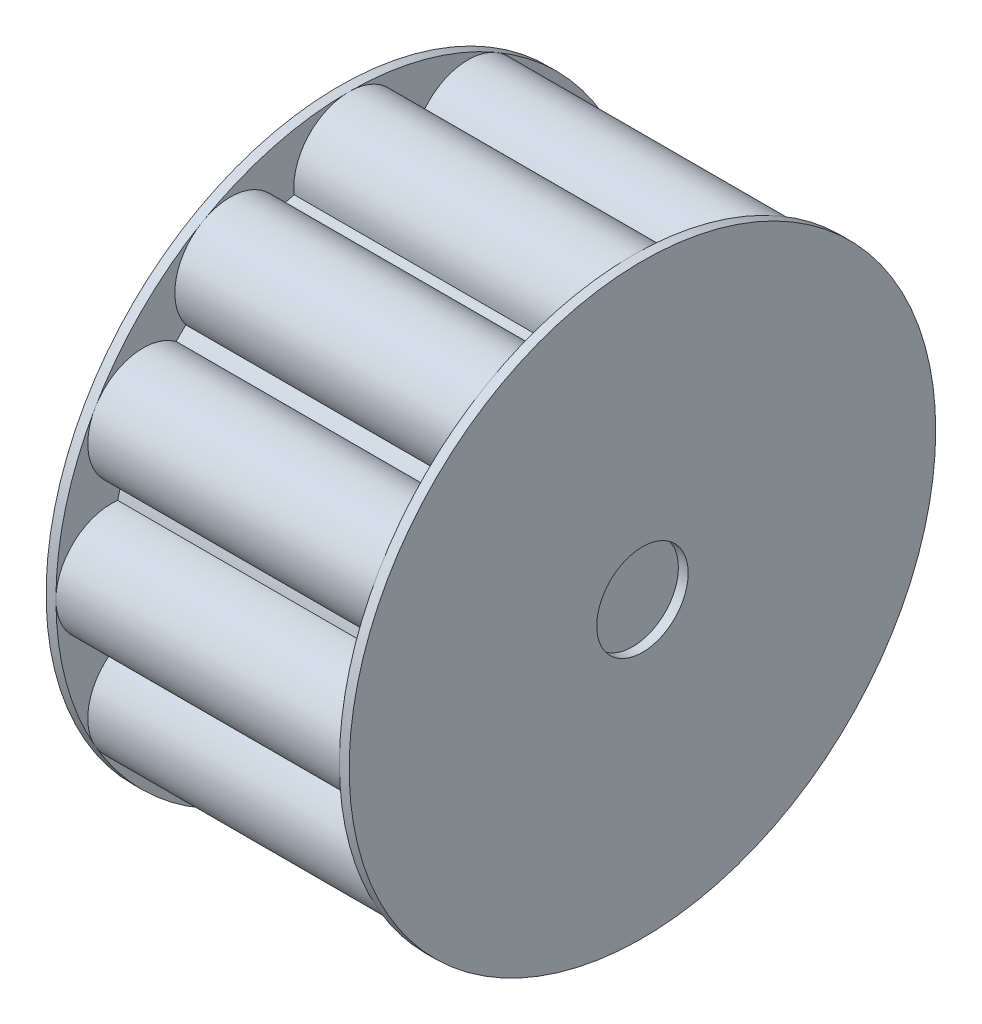
ISO-10303-21;
HEADER;
FILE_DESCRIPTION(('STEP AP214'),'2;1');
FILE_NAME('part.step','',(''),(''),'','','');
FILE_SCHEMA(('AUTOMOTIVE_DESIGN { 1 0 10303 214 1 1 1 1 }'));
ENDSEC;
DATA;
#1=APPLICATION_CONTEXT('core data for automotive mechanical design processes');
#2=APPLICATION_PROTOCOL_DEFINITION('international standard','automotive_design',2000,#1);
#3=PRODUCT_CONTEXT('',#1,'mechanical');
#4=PRODUCT('Part','Part','',(#3));
#5=PRODUCT_RELATED_PRODUCT_CATEGORY('part','',(#4));
#6=PRODUCT_DEFINITION_FORMATION('','',#4);
#7=PRODUCT_DEFINITION_CONTEXT('part definition',#1,'design');
#8=PRODUCT_DEFINITION('design','',#6,#7);
#9=PRODUCT_DEFINITION_SHAPE('','',#8);
#10=(LENGTH_UNIT() NAMED_UNIT(*) SI_UNIT(.MILLI.,.METRE.));
#11=(NAMED_UNIT(*) PLANE_ANGLE_UNIT() SI_UNIT($,.RADIAN.));
#12=(NAMED_UNIT(*) SI_UNIT($,.STERADIAN.) SOLID_ANGLE_UNIT());
#13=UNCERTAINTY_MEASURE_WITH_UNIT(LENGTH_MEASURE(1.E-05),#10,'distance_accuracy_value','');
#14=(GEOMETRIC_REPRESENTATION_CONTEXT(3) GLOBAL_UNCERTAINTY_ASSIGNED_CONTEXT((#13)) GLOBAL_UNIT_ASSIGNED_CONTEXT((#10,
#11,#12)) REPRESENTATION_CONTEXT('',''));
#15=CARTESIAN_POINT('',(0.,0.,0.));
#16=DIRECTION('',(0.,0.,1.));
#17=DIRECTION('',(1.,0.,0.));
#18=AXIS2_PLACEMENT_3D('',#15,#16,#17);
#19=CARTESIAN_POINT('',(30.,0.,0.));
#20=DIRECTION('',(-1.,0.,0.));
#21=DIRECTION('',(0.,0.,1.));
#22=AXIS2_PLACEMENT_3D('',#19,#20,#21);
#23=CYLINDRICAL_SURFACE('',#22,24.3358514709171);
#24=CARTESIAN_POINT('',(1.,0.,0.));
#25=DIRECTION('',(1.,0.,0.));
#26=DIRECTION('',(0.,0.,-1.));
#27=AXIS2_PLACEMENT_3D('',#24,#25,#26);
#28=CIRCLE('',#27,24.3358514709171);
#29=CARTESIAN_POINT('',(1.,23.6766886181635,5.62566288476854));
#30=VERTEX_POINT('',#29);
#31=CARTESIAN_POINT('',(1.,23.317445263208,6.96637733774414));
#32=VERTEX_POINT('',#31);
#33=EDGE_CURVE('E11',#30,#32,#28,.T.);
#34=ORIENTED_EDGE('',*,*,#33,.T.);
#35=DIRECTION('',(1.,0.,0.));
#36=VECTOR('',#35,1.);
#37=CARTESIAN_POINT('',(15.5,23.317445263208,6.96637733774413));
#38=LINE('',#37,#36);
#39=CARTESIAN_POINT('',(30.,23.317445263208,6.96637733774414));
#40=VERTEX_POINT('',#39);
#41=EDGE_CURVE('E283',#32,#40,#38,.T.);
#42=ORIENTED_EDGE('',*,*,#41,.T.);
#43=CARTESIAN_POINT('',(30.,0.,0.));
#44=DIRECTION('',(1.,0.,0.));
#45=DIRECTION('',(0.,0.,-1.));
#46=AXIS2_PLACEMENT_3D('',#43,#44,#45);
#47=CIRCLE('',#46,24.3358514709171);
#48=CARTESIAN_POINT('',(30.,23.6766886181635,5.62566288476854));
#49=VERTEX_POINT('',#48);
#50=EDGE_CURVE('E279',#49,#40,#47,.T.);
#51=ORIENTED_EDGE('',*,*,#50,.F.);
#52=DIRECTION('',(1.,0.,0.));
#53=VECTOR('',#52,1.);
#54=CARTESIAN_POINT('',(15.5,23.6766886181635,5.62566288476854));
#55=LINE('',#54,#53);
#56=EDGE_CURVE('E280',#49,#30,#55,.F.);
#57=ORIENTED_EDGE('',*,*,#56,.T.);
#58=EDGE_LOOP('',(#34,#42,#51,#57));
#59=FACE_BOUND('',#58,.T.);
#60=ADVANCED_FACE('F41',(#59),#23,.T.);
#61=CARTESIAN_POINT('',(1.,0.,0.));
#62=DIRECTION('',(1.,0.,0.));
#63=DIRECTION('',(0.,0.,-1.));
#64=AXIS2_PLACEMENT_3D('',#61,#62,#63);
#65=PLANE('',#64);
#66=CARTESIAN_POINT('',(1.,21.0754655965377,12.1679257354582));
#67=DIRECTION('',(1.,0.,0.));
#68=DIRECTION('',(0.,0.,-1.));
#69=AXIS2_PLACEMENT_3D('',#66,#67,#68);
#70=CIRCLE('',#69,5.66414852908402);
#71=CARTESIAN_POINT('',(1.,25.9807621135329,15.0000000000004));
#72=VERTEX_POINT('',#71);
#73=EDGE_CURVE('E544',#32,#72,#70,.T.);
#74=ORIENTED_EDGE('',*,*,#73,.F.);
#75=ORIENTED_EDGE('',*,*,#33,.F.);
#76=CARTESIAN_POINT('',(1.,24.3358514709171,0.));
#77=DIRECTION('',(1.,0.,0.));
#78=DIRECTION('',(0.,0.,-1.));
#79=AXIS2_PLACEMENT_3D('',#76,#77,#78);
#80=CIRCLE('',#79,5.66414852908295);
#81=CARTESIAN_POINT('',(1.,30.,0.));
#82=VERTEX_POINT('',#81);
#83=EDGE_CURVE('E295',#82,#30,#80,.T.);
#84=ORIENTED_EDGE('',*,*,#83,.F.);
#85=CARTESIAN_POINT('',(1.,0.,0.));
#86=DIRECTION('',(1.,0.,0.));
#87=DIRECTION('',(0.,0.,-1.));
#88=AXIS2_PLACEMENT_3D('',#85,#86,#87);
#89=CIRCLE('',#88,30.);
#90=EDGE_CURVE('E318',#82,#72,#89,.T.);
#91=ORIENTED_EDGE('',*,*,#90,.T.);
#92=EDGE_LOOP('',(#74,#75,#84,#91));
#93=FACE_BOUND('',#92,.T.);
#94=ADVANCED_FACE('F357',(#93),#65,.T.);
#95=CARTESIAN_POINT('',(30.,17.6917823784381,16.7103112804197));
#96=VERTEX_POINT('',#95);
#97=CARTESIAN_POINT('',(30.,16.7103112804194,17.6917823784384));
#98=VERTEX_POINT('',#97);
#99=EDGE_CURVE('E288',#96,#98,#47,.T.);
#100=ORIENTED_EDGE('',*,*,#99,.F.);
#101=DIRECTION('',(1.,0.,0.));
#102=VECTOR('',#101,1.);
#103=CARTESIAN_POINT('',(15.5,17.6917823784381,16.7103112804197));
#104=LINE('',#103,#102);
#105=CARTESIAN_POINT('',(1.,17.6917823784381,16.7103112804197));
#106=VERTEX_POINT('',#105);
#107=EDGE_CURVE('E536',#96,#106,#104,.F.);
#108=ORIENTED_EDGE('',*,*,#107,.T.);
#109=CARTESIAN_POINT('',(1.,16.7103112804194,17.6917823784384));
#110=VERTEX_POINT('',#109);
#111=EDGE_CURVE('E51',#106,#110,#28,.T.);
#112=ORIENTED_EDGE('',*,*,#111,.T.);
#113=DIRECTION('',(1.,0.,0.));
#114=VECTOR('',#113,1.);
#115=CARTESIAN_POINT('',(15.5,16.7103112804194,17.6917823784384));
#116=LINE('',#115,#114);
#117=EDGE_CURVE('E539',#110,#98,#116,.T.);
#118=ORIENTED_EDGE('',*,*,#117,.T.);
#119=EDGE_LOOP('',(#100,#108,#112,#118));
#120=FACE_BOUND('',#119,.T.);
#121=ADVANCED_FACE('F361',(#120),#23,.T.);
#122=EDGE_CURVE('E542',#72,#106,#70,.T.);
#123=ORIENTED_EDGE('',*,*,#122,.F.);
#124=CARTESIAN_POINT('',(1.,14.9999999999985,25.980762113534));
#125=VERTEX_POINT('',#124);
#126=EDGE_CURVE('E321',#72,#125,#89,.T.);
#127=ORIENTED_EDGE('',*,*,#126,.T.);
#128=CARTESIAN_POINT('',(1.,12.1679257354561,21.0754655965377));
#129=DIRECTION('',(1.,0.,0.));
#130=DIRECTION('',(0.,0.,-1.));
#131=AXIS2_PLACEMENT_3D('',#128,#129,#130);
#132=CIRCLE('',#131,5.66414852908526);
#133=EDGE_CURVE('E554',#110,#125,#132,.T.);
#134=ORIENTED_EDGE('',*,*,#133,.F.);
#135=ORIENTED_EDGE('',*,*,#111,.F.);
#136=EDGE_LOOP('',(#123,#127,#134,#135));
#137=FACE_BOUND('',#136,.T.);
#138=ADVANCED_FACE('F365',(#137),#65,.T.);
#139=CARTESIAN_POINT('',(30.,6.96637733774112,23.3174452632089));
#140=VERTEX_POINT('',#139);
#141=CARTESIAN_POINT('',(30.,5.62566288476978,23.6766886181632));
#142=VERTEX_POINT('',#141);
#143=EDGE_CURVE('E521',#140,#142,#47,.T.);
#144=ORIENTED_EDGE('',*,*,#143,.F.);
#145=DIRECTION('',(1.,0.,0.));
#146=VECTOR('',#145,1.);
#147=CARTESIAN_POINT('',(15.5,6.96637733774111,23.3174452632089));
#148=LINE('',#147,#146);
#149=CARTESIAN_POINT('',(1.,6.96637733774111,23.3174452632089));
#150=VERTEX_POINT('',#149);
#151=EDGE_CURVE('E558',#140,#150,#148,.F.);
#152=ORIENTED_EDGE('',*,*,#151,.T.);
#153=CARTESIAN_POINT('',(1.,5.62566288476978,23.6766886181632));
#154=VERTEX_POINT('',#153);
#155=EDGE_CURVE('E733',#150,#154,#28,.T.);
#156=ORIENTED_EDGE('',*,*,#155,.T.);
#157=DIRECTION('',(1.,0.,0.));
#158=VECTOR('',#157,1.);
#159=CARTESIAN_POINT('',(15.5,5.62566288476979,23.6766886181632));
#160=LINE('',#159,#158);
#161=EDGE_CURVE('E581',#154,#142,#160,.T.);
#162=ORIENTED_EDGE('',*,*,#161,.T.);
#163=EDGE_LOOP('',(#144,#152,#156,#162));
#164=FACE_BOUND('',#163,.T.);
#165=ADVANCED_FACE('F369',(#164),#23,.T.);
#166=EDGE_CURVE('E559',#125,#150,#132,.T.);
#167=ORIENTED_EDGE('',*,*,#166,.F.);
#168=CARTESIAN_POINT('',(1.,-3.40876816145015E-12,30.));
#169=VERTEX_POINT('',#168);
#170=EDGE_CURVE('E329',#125,#169,#89,.T.);
#171=ORIENTED_EDGE('',*,*,#170,.T.);
#172=CARTESIAN_POINT('',(1.,-2.76517585586108E-12,24.3358514709143));
#173=DIRECTION('',(1.,0.,0.));
#174=DIRECTION('',(0.,0.,-1.));
#175=AXIS2_PLACEMENT_3D('',#172,#173,#174);
#176=CIRCLE('',#175,5.66414852908664);
#177=EDGE_CURVE('E568',#154,#169,#176,.T.);
#178=ORIENTED_EDGE('',*,*,#177,.F.);
#179=ORIENTED_EDGE('',*,*,#155,.F.);
#180=EDGE_LOOP('',(#167,#171,#178,#179));
#181=FACE_BOUND('',#180,.T.);
#182=ADVANCED_FACE('F374',(#181),#65,.T.);
#183=CARTESIAN_POINT('',(30.,-5.62566288477516,23.6766886181619));
#184=VERTEX_POINT('',#183);
#185=CARTESIAN_POINT('',(30.,-6.96637733774395,23.317445263208));
#186=VERTEX_POINT('',#185);
#187=EDGE_CURVE('E518',#184,#186,#47,.T.);
#188=ORIENTED_EDGE('',*,*,#187,.F.);
#189=DIRECTION('',(1.,0.,0.));
#190=VECTOR('',#189,1.);
#191=CARTESIAN_POINT('',(15.5,-5.62566288477517,23.6766886181619));
#192=LINE('',#191,#190);
#193=CARTESIAN_POINT('',(1.,-5.62566288477517,23.6766886181619));
#194=VERTEX_POINT('',#193);
#195=EDGE_CURVE('E572',#184,#194,#192,.F.);
#196=ORIENTED_EDGE('',*,*,#195,.T.);
#197=CARTESIAN_POINT('',(1.,-6.96637733774395,23.317445263208));
#198=VERTEX_POINT('',#197);
#199=EDGE_CURVE('E1223',#194,#198,#28,.T.);
#200=ORIENTED_EDGE('',*,*,#199,.T.);
#201=DIRECTION('',(1.,0.,0.));
#202=VECTOR('',#201,1.);
#203=CARTESIAN_POINT('',(15.5,-6.96637733774394,23.317445263208));
#204=LINE('',#203,#202);
#205=EDGE_CURVE('E598',#198,#186,#204,.T.);
#206=ORIENTED_EDGE('',*,*,#205,.T.);
#207=EDGE_LOOP('',(#188,#196,#200,#206));
#208=FACE_BOUND('',#207,.T.);
#209=ADVANCED_FACE('F377',(#208),#23,.T.);
#210=EDGE_CURVE('E573',#169,#194,#176,.T.);
#211=ORIENTED_EDGE('',*,*,#210,.F.);
#212=CARTESIAN_POINT('',(1.,-15.0000000000044,25.9807621135306));
#213=VERTEX_POINT('',#212);
#214=EDGE_CURVE('E1262',#169,#213,#89,.T.);
#215=ORIENTED_EDGE('',*,*,#214,.T.);
#216=CARTESIAN_POINT('',(1.,-12.1679257354609,21.0754655965349));
#217=DIRECTION('',(1.,0.,0.));
#218=DIRECTION('',(0.,0.,-1.));
#219=AXIS2_PLACEMENT_3D('',#216,#217,#218);
#220=CIRCLE('',#219,5.66414852908784);
#221=EDGE_CURVE('E585',#198,#213,#220,.T.);
#222=ORIENTED_EDGE('',*,*,#221,.F.);
#223=ORIENTED_EDGE('',*,*,#199,.F.);
#224=EDGE_LOOP('',(#211,#215,#222,#223));
#225=FACE_BOUND('',#224,.T.);
#226=ADVANCED_FACE('F382',(#225),#65,.T.);
#227=CARTESIAN_POINT('',(30.,-16.7103112804254,17.6917823784328));
#228=VERTEX_POINT('',#227);
#229=CARTESIAN_POINT('',(30.,-17.6917823784388,16.710311280419));
#230=VERTEX_POINT('',#229);
#231=EDGE_CURVE('E515',#228,#230,#47,.T.);
#232=ORIENTED_EDGE('',*,*,#231,.F.);
#233=DIRECTION('',(1.,0.,0.));
#234=VECTOR('',#233,1.);
#235=CARTESIAN_POINT('',(15.5,-16.7103112804254,17.6917823784328));
#236=LINE('',#235,#234);
#237=CARTESIAN_POINT('',(1.,-16.7103112804254,17.6917823784328));
#238=VERTEX_POINT('',#237);
#239=EDGE_CURVE('E589',#228,#238,#236,.F.);
#240=ORIENTED_EDGE('',*,*,#239,.T.);
#241=CARTESIAN_POINT('',(1.,-17.6917823784388,16.710311280419));
#242=VERTEX_POINT('',#241);
#243=EDGE_CURVE('E1226',#238,#242,#28,.T.);
#244=ORIENTED_EDGE('',*,*,#243,.T.);
#245=DIRECTION('',(1.,0.,0.));
#246=VECTOR('',#245,1.);
#247=CARTESIAN_POINT('',(15.5,-17.6917823784388,16.710311280419));
#248=LINE('',#247,#246);
#249=EDGE_CURVE('E615',#242,#230,#248,.T.);
#250=ORIENTED_EDGE('',*,*,#249,.T.);
#251=EDGE_LOOP('',(#232,#240,#244,#250));
#252=FACE_BOUND('',#251,.T.);
#253=ADVANCED_FACE('F385',(#252),#23,.T.);
#254=EDGE_CURVE('E590',#213,#238,#220,.T.);
#255=ORIENTED_EDGE('',*,*,#254,.F.);
#256=CARTESIAN_POINT('',(1.,-25.9807621135363,14.9999999999945));
#257=VERTEX_POINT('',#256);
#258=EDGE_CURVE('E1258',#213,#257,#89,.T.);
#259=ORIENTED_EDGE('',*,*,#258,.T.);
#260=CARTESIAN_POINT('',(1.,-21.0754655965405,12.1679257354534));
#261=DIRECTION('',(1.,0.,0.));
#262=DIRECTION('',(0.,0.,-1.));
#263=AXIS2_PLACEMENT_3D('',#260,#261,#262);
#264=CIRCLE('',#263,5.66414852908847);
#265=EDGE_CURVE('E602',#242,#257,#264,.T.);
#266=ORIENTED_EDGE('',*,*,#265,.F.);
#267=ORIENTED_EDGE('',*,*,#243,.F.);
#268=EDGE_LOOP('',(#255,#259,#266,#267));
#269=FACE_BOUND('',#268,.T.);
#270=ADVANCED_FACE('F390',(#269),#65,.T.);
#271=CARTESIAN_POINT('',(30.,-23.3174452632109,6.96637733773451));
#272=VERTEX_POINT('',#271);
#273=CARTESIAN_POINT('',(30.,-23.6766886181635,5.6256628847685));
#274=VERTEX_POINT('',#273);
#275=EDGE_CURVE('E512',#272,#274,#47,.T.);
#276=ORIENTED_EDGE('',*,*,#275,.F.);
#277=DIRECTION('',(1.,0.,0.));
#278=VECTOR('',#277,1.);
#279=CARTESIAN_POINT('',(15.5,-23.3174452632109,6.96637733773452));
#280=LINE('',#279,#278);
#281=CARTESIAN_POINT('',(1.,-23.3174452632109,6.96637733773452));
#282=VERTEX_POINT('',#281);
#283=EDGE_CURVE('E606',#272,#282,#280,.F.);
#284=ORIENTED_EDGE('',*,*,#283,.T.);
#285=CARTESIAN_POINT('',(1.,-23.6766886181635,5.6256628847685));
#286=VERTEX_POINT('',#285);
#287=EDGE_CURVE('E1229',#282,#286,#28,.T.);
#288=ORIENTED_EDGE('',*,*,#287,.T.);
#289=DIRECTION('',(1.,0.,0.));
#290=VECTOR('',#289,1.);
#291=CARTESIAN_POINT('',(15.5,-23.6766886181635,5.6256628847685));
#292=LINE('',#291,#290);
#293=EDGE_CURVE('E632',#286,#274,#292,.T.);
#294=ORIENTED_EDGE('',*,*,#293,.T.);
#295=EDGE_LOOP('',(#276,#284,#288,#294));
#296=FACE_BOUND('',#295,.T.);
#297=ADVANCED_FACE('F393',(#296),#23,.T.);
#298=EDGE_CURVE('E607',#257,#282,#264,.T.);
#299=ORIENTED_EDGE('',*,*,#298,.F.);
#300=CARTESIAN_POINT('',(1.,-30.,-6.81018844210464E-12));
#301=VERTEX_POINT('',#300);
#302=EDGE_CURVE('E1255',#257,#301,#89,.T.);
#303=ORIENTED_EDGE('',*,*,#302,.T.);
#304=CARTESIAN_POINT('',(1.,-24.3358514709171,-5.52439114720048E-12));
#305=DIRECTION('',(1.,0.,0.));
#306=DIRECTION('',(0.,0.,-1.));
#307=AXIS2_PLACEMENT_3D('',#304,#305,#306);
#308=CIRCLE('',#307,5.66414852908839);
#309=EDGE_CURVE('E623',#286,#301,#308,.T.);
#310=ORIENTED_EDGE('',*,*,#309,.F.);
#311=ORIENTED_EDGE('',*,*,#287,.F.);
#312=EDGE_LOOP('',(#299,#303,#310,#311));
#313=FACE_BOUND('',#312,.T.);
#314=ADVANCED_FACE('F398',(#313),#65,.T.);
#315=CARTESIAN_POINT('',(30.,-23.676688618161,-5.62566288477925));
#316=VERTEX_POINT('',#315);
#317=CARTESIAN_POINT('',(30.,-23.3174452632076,-6.96637733774555));
#318=VERTEX_POINT('',#317);
#319=EDGE_CURVE('E509',#316,#318,#47,.T.);
#320=ORIENTED_EDGE('',*,*,#319,.F.);
#321=DIRECTION('',(1.,0.,0.));
#322=VECTOR('',#321,1.);
#323=CARTESIAN_POINT('',(15.5,-23.676688618161,-5.62566288477925));
#324=LINE('',#323,#322);
#325=CARTESIAN_POINT('',(1.,-23.676688618161,-5.62566288477925));
#326=VERTEX_POINT('',#325);
#327=EDGE_CURVE('E628',#316,#326,#324,.F.);
#328=ORIENTED_EDGE('',*,*,#327,.T.);
#329=CARTESIAN_POINT('',(1.,-23.3174452632076,-6.96637733774555));
#330=VERTEX_POINT('',#329);
#331=EDGE_CURVE('E1232',#326,#330,#28,.T.);
#332=ORIENTED_EDGE('',*,*,#331,.T.);
#333=DIRECTION('',(1.,0.,0.));
#334=VECTOR('',#333,1.);
#335=CARTESIAN_POINT('',(15.5,-23.3174452632076,-6.96637733774554));
#336=LINE('',#335,#334);
#337=EDGE_CURVE('E649',#330,#318,#336,.T.);
#338=ORIENTED_EDGE('',*,*,#337,.T.);
#339=EDGE_LOOP('',(#320,#328,#332,#338));
#340=FACE_BOUND('',#339,.T.);
#341=ADVANCED_FACE('F401',(#340),#23,.T.);
#342=EDGE_CURVE('E619',#301,#326,#308,.T.);
#343=ORIENTED_EDGE('',*,*,#342,.F.);
#344=CARTESIAN_POINT('',(1.,-25.98076211353,-15.0000000000055));
#345=VERTEX_POINT('',#344);
#346=EDGE_CURVE('E1253',#301,#345,#89,.T.);
#347=ORIENTED_EDGE('',*,*,#346,.T.);
#348=CARTESIAN_POINT('',(1.,-21.0754655965377,-12.1679257354637));
#349=DIRECTION('',(1.,0.,0.));
#350=DIRECTION('',(0.,0.,-1.));
#351=AXIS2_PLACEMENT_3D('',#348,#349,#350);
#352=CIRCLE('',#351,5.66414852908762);
#353=EDGE_CURVE('E640',#330,#345,#352,.T.);
#354=ORIENTED_EDGE('',*,*,#353,.F.);
#355=ORIENTED_EDGE('',*,*,#331,.F.);
#356=EDGE_LOOP('',(#343,#347,#354,#355));
#357=FACE_BOUND('',#356,.T.);
#358=ADVANCED_FACE('F406',(#357),#65,.T.);
#359=CARTESIAN_POINT('',(30.,-17.6917823784325,-16.7103112804256));
#360=VERTEX_POINT('',#359);
#361=CARTESIAN_POINT('',(30.,-16.7103112804178,-17.6917823784399));
#362=VERTEX_POINT('',#361);
#363=EDGE_CURVE('E506',#360,#362,#47,.T.);
#364=ORIENTED_EDGE('',*,*,#363,.F.);
#365=DIRECTION('',(1.,0.,0.));
#366=VECTOR('',#365,1.);
#367=CARTESIAN_POINT('',(15.5,-17.6917823784325,-16.7103112804256));
#368=LINE('',#367,#366);
#369=CARTESIAN_POINT('',(1.,-17.6917823784325,-16.7103112804256));
#370=VERTEX_POINT('',#369);
#371=EDGE_CURVE('E645',#360,#370,#368,.F.);
#372=ORIENTED_EDGE('',*,*,#371,.T.);
#373=CARTESIAN_POINT('',(1.,-16.7103112804178,-17.6917823784399));
#374=VERTEX_POINT('',#373);
#375=EDGE_CURVE('E1235',#370,#374,#28,.T.);
#376=ORIENTED_EDGE('',*,*,#375,.T.);
#377=DIRECTION('',(1.,0.,0.));
#378=VECTOR('',#377,1.);
#379=CARTESIAN_POINT('',(15.5,-16.7103112804178,-17.6917823784399));
#380=LINE('',#379,#378);
#381=EDGE_CURVE('E666',#374,#362,#380,.T.);
#382=ORIENTED_EDGE('',*,*,#381,.T.);
#383=EDGE_LOOP('',(#364,#372,#376,#382));
#384=FACE_BOUND('',#383,.T.);
#385=ADVANCED_FACE('F409',(#384),#23,.T.);
#386=EDGE_CURVE('E636',#345,#370,#352,.T.);
#387=ORIENTED_EDGE('',*,*,#386,.F.);
#388=CARTESIAN_POINT('',(1.,-14.9999999999956,-25.9807621135357));
#389=VERTEX_POINT('',#388);
#390=EDGE_CURVE('E1247',#345,#389,#89,.T.);
#391=ORIENTED_EDGE('',*,*,#390,.T.);
#392=CARTESIAN_POINT('',(1.,-12.1679257354561,-21.0754655965432));
#393=DIRECTION('',(1.,0.,0.));
#394=DIRECTION('',(0.,0.,-1.));
#395=AXIS2_PLACEMENT_3D('',#392,#393,#394);
#396=CIRCLE('',#395,5.66414852908633);
#397=EDGE_CURVE('E657',#374,#389,#396,.T.);
#398=ORIENTED_EDGE('',*,*,#397,.F.);
#399=ORIENTED_EDGE('',*,*,#375,.F.);
#400=EDGE_LOOP('',(#387,#391,#398,#399));
#401=FACE_BOUND('',#400,.T.);
#402=ADVANCED_FACE('F414',(#401),#65,.T.);
#403=CARTESIAN_POINT('',(30.,-6.96637733773798,-23.3174452632098));
#404=VERTEX_POINT('',#403);
#405=CARTESIAN_POINT('',(30.,-5.62566288476744,-23.6766886181638));
#406=VERTEX_POINT('',#405);
#407=EDGE_CURVE('E503',#404,#406,#47,.T.);
#408=ORIENTED_EDGE('',*,*,#407,.F.);
#409=DIRECTION('',(1.,0.,0.));
#410=VECTOR('',#409,1.);
#411=CARTESIAN_POINT('',(15.5,-6.96637733773798,-23.3174452632098));
#412=LINE('',#411,#410);
#413=CARTESIAN_POINT('',(1.,-6.96637733773798,-23.3174452632098));
#414=VERTEX_POINT('',#413);
#415=EDGE_CURVE('E662',#404,#414,#412,.F.);
#416=ORIENTED_EDGE('',*,*,#415,.T.);
#417=CARTESIAN_POINT('',(1.,-5.62566288476744,-23.6766886181638));
#418=VERTEX_POINT('',#417);
#419=EDGE_CURVE('E689',#414,#418,#28,.T.);
#420=ORIENTED_EDGE('',*,*,#419,.T.);
#421=DIRECTION('',(1.,0.,0.));
#422=VECTOR('',#421,1.);
#423=CARTESIAN_POINT('',(15.5,-5.62566288476742,-23.6766886181638));
#424=LINE('',#423,#422);
#425=EDGE_CURVE('E474',#418,#406,#424,.T.);
#426=ORIENTED_EDGE('',*,*,#425,.T.);
#427=EDGE_LOOP('',(#408,#416,#420,#426));
#428=FACE_BOUND('',#427,.T.);
#429=ADVANCED_FACE('F417',(#428),#23,.T.);
#430=CARTESIAN_POINT('',(1.,2.76219557360024E-12,-24.3358514709198));
#431=DIRECTION('',(1.,0.,0.));
#432=DIRECTION('',(0.,0.,-1.));
#433=AXIS2_PLACEMENT_3D('',#430,#431,#432);
#434=CIRCLE('',#433,5.66414852908487);
#435=CARTESIAN_POINT('',(1.,3.40509422105246E-12,-30.0000000000047));
#436=VERTEX_POINT('',#435);
#437=CARTESIAN_POINT('',(1.,5.62566288477281,-23.6766886181625));
#438=VERTEX_POINT('',#437);
#439=EDGE_CURVE('E670',#436,#438,#434,.T.);
#440=ORIENTED_EDGE('',*,*,#439,.F.);
#441=CARTESIAN_POINT('',(1.,15.000000000003,-25.980762113535));
#442=VERTEX_POINT('',#441);
#443=EDGE_CURVE('E338',#436,#442,#89,.T.);
#444=ORIENTED_EDGE('',*,*,#443,.T.);
#445=CARTESIAN_POINT('',(1.,12.1679257354609,-21.0754655965404));
#446=DIRECTION('',(1.,0.,0.));
#447=DIRECTION('',(0.,0.,-1.));
#448=AXIS2_PLACEMENT_3D('',#445,#446,#447);
#449=CIRCLE('',#448,5.66414852908362);
#450=CARTESIAN_POINT('',(1.,6.9663773377459,-23.3174452632075));
#451=VERTEX_POINT('',#450);
#452=EDGE_CURVE('E478',#451,#442,#449,.T.);
#453=ORIENTED_EDGE('',*,*,#452,.F.);
#454=EDGE_CURVE('E682',#438,#451,#28,.T.);
#455=ORIENTED_EDGE('',*,*,#454,.F.);
#456=EDGE_LOOP('',(#440,#444,#453,#455));
#457=FACE_BOUND('',#456,.T.);
#458=ADVANCED_FACE('F422',(#457),#65,.T.);
#459=CARTESIAN_POINT('',(30.,5.62566288477281,-23.6766886181625));
#460=VERTEX_POINT('',#459);
#461=CARTESIAN_POINT('',(30.,6.9663773377459,-23.3174452632075));
#462=VERTEX_POINT('',#461);
#463=EDGE_CURVE('E453',#460,#462,#47,.T.);
#464=ORIENTED_EDGE('',*,*,#463,.F.);
#465=DIRECTION('',(1.,0.,0.));
#466=VECTOR('',#465,1.);
#467=CARTESIAN_POINT('',(15.5,5.62566288477279,-23.6766886181625));
#468=LINE('',#467,#466);
#469=EDGE_CURVE('E479',#460,#438,#468,.F.);
#470=ORIENTED_EDGE('',*,*,#469,.T.);
#471=ORIENTED_EDGE('',*,*,#454,.T.);
#472=DIRECTION('',(1.,0.,0.));
#473=VECTOR('',#472,1.);
#474=CARTESIAN_POINT('',(15.5,6.96637733774589,-23.3174452632075));
#475=LINE('',#474,#473);
#476=EDGE_CURVE('E465',#451,#462,#475,.T.);
#477=ORIENTED_EDGE('',*,*,#476,.T.);
#478=EDGE_LOOP('',(#464,#470,#471,#477));
#479=FACE_BOUND('',#478,.T.);
#480=ADVANCED_FACE('F425',(#479),#23,.T.);
#481=CARTESIAN_POINT('',(1.,16.7103112804198,-17.691782378438));
#482=VERTEX_POINT('',#481);
#483=EDGE_CURVE('E463',#442,#482,#449,.T.);
#484=ORIENTED_EDGE('',*,*,#483,.F.);
#485=CARTESIAN_POINT('',(1.,25.9807621135346,-15.0000000000003));
#486=VERTEX_POINT('',#485);
#487=EDGE_CURVE('E331',#442,#486,#89,.T.);
#488=ORIENTED_EDGE('',*,*,#487,.T.);
#489=CARTESIAN_POINT('',(1.,21.0754655965404,-12.1679257354589));
#490=DIRECTION('',(1.,0.,0.));
#491=DIRECTION('',(0.,0.,-1.));
#492=AXIS2_PLACEMENT_3D('',#489,#490,#491);
#493=CIRCLE('',#492,5.66414852908292);
#494=CARTESIAN_POINT('',(1.,17.6917823784396,-16.7103112804182));
#495=VERTEX_POINT('',#494);
#496=EDGE_CURVE('E488',#495,#486,#493,.T.);
#497=ORIENTED_EDGE('',*,*,#496,.F.);
#498=EDGE_CURVE('E328',#482,#495,#28,.T.);
#499=ORIENTED_EDGE('',*,*,#498,.F.);
#500=EDGE_LOOP('',(#484,#488,#497,#499));
#501=FACE_BOUND('',#500,.T.);
#502=ADVANCED_FACE('F430',(#501),#65,.T.);
#503=CARTESIAN_POINT('',(1.,23.3174452632078,-6.96637733774478));
#504=VERTEX_POINT('',#503);
#505=EDGE_CURVE('E485',#486,#504,#493,.T.);
#506=ORIENTED_EDGE('',*,*,#505,.F.);
#507=EDGE_CURVE('E322',#486,#82,#89,.T.);
#508=ORIENTED_EDGE('',*,*,#507,.T.);
#509=CARTESIAN_POINT('',(1.,23.6766886181635,-5.62566288476854));
#510=VERTEX_POINT('',#509);
#511=EDGE_CURVE('E310',#510,#82,#80,.T.);
#512=ORIENTED_EDGE('',*,*,#511,.F.);
#513=EDGE_CURVE('E53',#504,#510,#28,.T.);
#514=ORIENTED_EDGE('',*,*,#513,.F.);
#515=EDGE_LOOP('',(#506,#508,#512,#514));
#516=FACE_BOUND('',#515,.T.);
#517=ADVANCED_FACE('F358',(#516),#65,.T.);
#518=CARTESIAN_POINT('',(30.,16.7103112804198,-17.691782378438));
#519=VERTEX_POINT('',#518);
#520=CARTESIAN_POINT('',(30.,17.6917823784396,-16.7103112804182));
#521=VERTEX_POINT('',#520);
#522=EDGE_CURVE('E445',#519,#521,#47,.T.);
#523=ORIENTED_EDGE('',*,*,#522,.F.);
#524=DIRECTION('',(1.,0.,0.));
#525=VECTOR('',#524,1.);
#526=CARTESIAN_POINT('',(15.5,16.7103112804199,-17.691782378438));
#527=LINE('',#526,#525);
#528=EDGE_CURVE('E447',#519,#482,#527,.F.);
#529=ORIENTED_EDGE('',*,*,#528,.T.);
#530=ORIENTED_EDGE('',*,*,#498,.T.);
#531=DIRECTION('',(1.,0.,0.));
#532=VECTOR('',#531,1.);
#533=CARTESIAN_POINT('',(15.5,17.6917823784396,-16.7103112804182));
#534=LINE('',#533,#532);
#535=EDGE_CURVE('E306',#495,#521,#534,.T.);
#536=ORIENTED_EDGE('',*,*,#535,.T.);
#537=EDGE_LOOP('',(#523,#529,#530,#536));
#538=FACE_BOUND('',#537,.T.);
#539=ADVANCED_FACE('F354',(#538),#23,.T.);
#540=CARTESIAN_POINT('',(1.,0.,0.));
#541=DIRECTION('',(-1.,0.,0.));
#542=DIRECTION('',(0.,0.,1.));
#543=AXIS2_PLACEMENT_3D('',#540,#541,#542);
#544=CYLINDRICAL_SURFACE('',#543,30.);
#545=ORIENTED_EDGE('',*,*,#90,.F.);
#546=ORIENTED_EDGE('',*,*,#507,.F.);
#547=ORIENTED_EDGE('',*,*,#487,.F.);
#548=ORIENTED_EDGE('',*,*,#443,.F.);
#549=EDGE_CURVE('E1243',#389,#436,#89,.T.);
#550=ORIENTED_EDGE('',*,*,#549,.F.);
#551=ORIENTED_EDGE('',*,*,#390,.F.);
#552=ORIENTED_EDGE('',*,*,#346,.F.);
#553=ORIENTED_EDGE('',*,*,#302,.F.);
#554=ORIENTED_EDGE('',*,*,#258,.F.);
#555=ORIENTED_EDGE('',*,*,#214,.F.);
#556=ORIENTED_EDGE('',*,*,#170,.F.);
#557=ORIENTED_EDGE('',*,*,#126,.F.);
#558=EDGE_LOOP('',(#545,#546,#547,#548,#550,#551,#552,#553,#554,#555,#556,#557));
#559=FACE_BOUND('',#558,.T.);
#560=CARTESIAN_POINT('',(0.,0.,0.));
#561=DIRECTION('',(1.,0.,0.));
#562=DIRECTION('',(0.,0.,-1.));
#563=AXIS2_PLACEMENT_3D('',#560,#561,#562);
#564=CIRCLE('',#563,30.);
#565=CARTESIAN_POINT('',(0.,0.,-30.));
#566=VERTEX_POINT('',#565);
#567=EDGE_CURVE('E45',#566,#566,#564,.T.);
#568=ORIENTED_EDGE('',*,*,#567,.T.);
#569=EDGE_LOOP('',(#568));
#570=FACE_BOUND('',#569,.T.);
#571=ADVANCED_FACE('F43',(#559,#570),#544,.T.);
#572=EDGE_CURVE('E653',#389,#414,#396,.T.);
#573=ORIENTED_EDGE('',*,*,#572,.F.);
#574=ORIENTED_EDGE('',*,*,#549,.T.);
#575=EDGE_CURVE('E674',#418,#436,#434,.T.);
#576=ORIENTED_EDGE('',*,*,#575,.F.);
#577=ORIENTED_EDGE('',*,*,#419,.F.);
#578=EDGE_LOOP('',(#573,#574,#576,#577));
#579=FACE_BOUND('',#578,.T.);
#580=ADVANCED_FACE('F346',(#579),#65,.T.);
#581=CARTESIAN_POINT('',(0.,0.,0.));
#582=DIRECTION('',(1.,0.,0.));
#583=DIRECTION('',(0.,0.,-1.));
#584=AXIS2_PLACEMENT_3D('',#581,#582,#583);
#585=PLANE('',#584);
#586=CARTESIAN_POINT('',(0.,0.,0.));
#587=DIRECTION('',(-1.,0.,0.));
#588=DIRECTION('',(0.,0.,1.));
#589=AXIS2_PLACEMENT_3D('',#586,#587,#588);
#590=CIRCLE('',#589,4.68150174196716);
#591=CARTESIAN_POINT('',(0.,0.,4.68150174196716));
#592=VERTEX_POINT('',#591);
#593=EDGE_CURVE('E764',#592,#592,#590,.T.);
#594=ORIENTED_EDGE('',*,*,#593,.F.);
#595=EDGE_LOOP('',(#594));
#596=FACE_BOUND('',#595,.T.);
#597=ORIENTED_EDGE('',*,*,#567,.F.);
#598=EDGE_LOOP('',(#597));
#599=FACE_BOUND('',#598,.T.);
#600=ADVANCED_FACE('F343',(#596,#599),#585,.F.);
#601=CARTESIAN_POINT('',(30.,23.3174452632078,-6.96637733774478));
#602=VERTEX_POINT('',#601);
#603=CARTESIAN_POINT('',(30.,23.6766886181635,-5.62566288476854));
#604=VERTEX_POINT('',#603);
#605=EDGE_CURVE('E290',#602,#604,#47,.T.);
#606=ORIENTED_EDGE('',*,*,#605,.F.);
#607=DIRECTION('',(1.,0.,0.));
#608=VECTOR('',#607,1.);
#609=CARTESIAN_POINT('',(15.5,23.3174452632078,-6.96637733774478));
#610=LINE('',#609,#608);
#611=EDGE_CURVE('E312',#602,#504,#610,.F.);
#612=ORIENTED_EDGE('',*,*,#611,.T.);
#613=ORIENTED_EDGE('',*,*,#513,.T.);
#614=DIRECTION('',(1.,0.,0.));
#615=VECTOR('',#614,1.);
#616=CARTESIAN_POINT('',(15.5,23.6766886181635,-5.62566288476854));
#617=LINE('',#616,#615);
#618=EDGE_CURVE('E297',#510,#604,#617,.T.);
#619=ORIENTED_EDGE('',*,*,#618,.T.);
#620=EDGE_LOOP('',(#606,#612,#613,#619));
#621=FACE_BOUND('',#620,.T.);
#622=ADVANCED_FACE('F345',(#621),#23,.T.);
#623=CARTESIAN_POINT('',(1.,24.3358514709171,0.));
#624=DIRECTION('',(1.,0.,0.));
#625=DIRECTION('',(0.,0.,-1.));
#626=AXIS2_PLACEMENT_3D('',#623,#624,#625);
#627=CYLINDRICAL_SURFACE('',#626,5.66414852908295);
#628=ORIENTED_EDGE('',*,*,#618,.F.);
#629=ORIENTED_EDGE('',*,*,#511,.T.);
#630=ORIENTED_EDGE('',*,*,#83,.T.);
#631=ORIENTED_EDGE('',*,*,#56,.F.);
#632=CARTESIAN_POINT('',(30.,24.3358514709171,0.));
#633=DIRECTION('',(1.,0.,0.));
#634=DIRECTION('',(0.,0.,-1.));
#635=AXIS2_PLACEMENT_3D('',#632,#633,#634);
#636=CIRCLE('',#635,5.66414852908295);
#637=CARTESIAN_POINT('',(30.,30.,0.));
#638=VERTEX_POINT('',#637);
#639=EDGE_CURVE('E60',#638,#49,#636,.T.);
#640=ORIENTED_EDGE('',*,*,#639,.F.);
#641=EDGE_CURVE('E305',#604,#638,#636,.T.);
#642=ORIENTED_EDGE('',*,*,#641,.F.);
#643=EDGE_LOOP('',(#628,#629,#630,#631,#640,#642));
#644=FACE_BOUND('',#643,.T.);
#645=ADVANCED_FACE('F292',(#644),#627,.T.);
#646=CARTESIAN_POINT('',(1.,21.0754655965404,-12.1679257354589));
#647=DIRECTION('',(1.,0.,0.));
#648=DIRECTION('',(0.,0.,-1.));
#649=AXIS2_PLACEMENT_3D('',#646,#647,#648);
#650=CYLINDRICAL_SURFACE('',#649,5.66414852908292);
#651=ORIENTED_EDGE('',*,*,#535,.F.);
#652=ORIENTED_EDGE('',*,*,#496,.T.);
#653=ORIENTED_EDGE('',*,*,#505,.T.);
#654=ORIENTED_EDGE('',*,*,#611,.F.);
#655=CARTESIAN_POINT('',(30.,21.0754655965404,-12.1679257354589));
#656=DIRECTION('',(1.,0.,0.));
#657=DIRECTION('',(0.,0.,-1.));
#658=AXIS2_PLACEMENT_3D('',#655,#656,#657);
#659=CIRCLE('',#658,5.66414852908292);
#660=CARTESIAN_POINT('',(30.,25.9807621135346,-15.0000000000003));
#661=VERTEX_POINT('',#660);
#662=EDGE_CURVE('E68',#661,#602,#659,.T.);
#663=ORIENTED_EDGE('',*,*,#662,.F.);
#664=EDGE_CURVE('E489',#521,#661,#659,.T.);
#665=ORIENTED_EDGE('',*,*,#664,.F.);
#666=EDGE_LOOP('',(#651,#652,#653,#654,#663,#665));
#667=FACE_BOUND('',#666,.T.);
#668=ADVANCED_FACE('F835',(#667),#650,.T.);
#669=CARTESIAN_POINT('',(1.,12.1679257354609,-21.0754655965404));
#670=DIRECTION('',(1.,0.,0.));
#671=DIRECTION('',(0.,0.,-1.));
#672=AXIS2_PLACEMENT_3D('',#669,#670,#671);
#673=CYLINDRICAL_SURFACE('',#672,5.66414852908362);
#674=ORIENTED_EDGE('',*,*,#476,.F.);
#675=ORIENTED_EDGE('',*,*,#452,.T.);
#676=ORIENTED_EDGE('',*,*,#483,.T.);
#677=ORIENTED_EDGE('',*,*,#528,.F.);
#678=CARTESIAN_POINT('',(30.,12.1679257354609,-21.0754655965404));
#679=DIRECTION('',(1.,0.,0.));
#680=DIRECTION('',(0.,0.,-1.));
#681=AXIS2_PLACEMENT_3D('',#678,#679,#680);
#682=CIRCLE('',#681,5.66414852908362);
#683=CARTESIAN_POINT('',(30.,15.000000000003,-25.980762113535));
#684=VERTEX_POINT('',#683);
#685=EDGE_CURVE('E459',#684,#519,#682,.T.);
#686=ORIENTED_EDGE('',*,*,#685,.F.);
#687=EDGE_CURVE('E473',#462,#684,#682,.T.);
#688=ORIENTED_EDGE('',*,*,#687,.F.);
#689=EDGE_LOOP('',(#674,#675,#676,#677,#686,#688));
#690=FACE_BOUND('',#689,.T.);
#691=ADVANCED_FACE('F457',(#690),#673,.T.);
#692=CARTESIAN_POINT('',(1.,2.76219557360024E-12,-24.3358514709198));
#693=DIRECTION('',(1.,0.,0.));
#694=DIRECTION('',(0.,0.,-1.));
#695=AXIS2_PLACEMENT_3D('',#692,#693,#694);
#696=CYLINDRICAL_SURFACE('',#695,5.66414852908487);
#697=ORIENTED_EDGE('',*,*,#425,.F.);
#698=ORIENTED_EDGE('',*,*,#575,.T.);
#699=ORIENTED_EDGE('',*,*,#439,.T.);
#700=ORIENTED_EDGE('',*,*,#469,.F.);
#701=CARTESIAN_POINT('',(30.,2.76219557360024E-12,-24.3358514709198));
#702=DIRECTION('',(1.,0.,0.));
#703=DIRECTION('',(0.,0.,-1.));
#704=AXIS2_PLACEMENT_3D('',#701,#702,#703);
#705=CIRCLE('',#704,5.66414852908487);
#706=CARTESIAN_POINT('',(30.,3.40509422105246E-12,-30.0000000000047));
#707=VERTEX_POINT('',#706);
#708=EDGE_CURVE('E669',#707,#460,#705,.T.);
#709=ORIENTED_EDGE('',*,*,#708,.F.);
#710=EDGE_CURVE('E675',#406,#707,#705,.T.);
#711=ORIENTED_EDGE('',*,*,#710,.F.);
#712=EDGE_LOOP('',(#697,#698,#699,#700,#709,#711));
#713=FACE_BOUND('',#712,.T.);
#714=ADVANCED_FACE('F691',(#713),#696,.T.);
#715=CARTESIAN_POINT('',(1.,-12.1679257354561,-21.0754655965432));
#716=DIRECTION('',(1.,0.,0.));
#717=DIRECTION('',(0.,0.,-1.));
#718=AXIS2_PLACEMENT_3D('',#715,#716,#717);
#719=CYLINDRICAL_SURFACE('',#718,5.66414852908633);
#720=ORIENTED_EDGE('',*,*,#381,.F.);
#721=ORIENTED_EDGE('',*,*,#397,.T.);
#722=ORIENTED_EDGE('',*,*,#572,.T.);
#723=ORIENTED_EDGE('',*,*,#415,.F.);
#724=CARTESIAN_POINT('',(30.,-12.1679257354561,-21.0754655965432));
#725=DIRECTION('',(1.,0.,0.));
#726=DIRECTION('',(0.,0.,-1.));
#727=AXIS2_PLACEMENT_3D('',#724,#725,#726);
#728=CIRCLE('',#727,5.66414852908633);
#729=CARTESIAN_POINT('',(30.,-14.9999999999985,-25.9807621135407));
#730=VERTEX_POINT('',#729);
#731=EDGE_CURVE('E652',#730,#404,#728,.T.);
#732=ORIENTED_EDGE('',*,*,#731,.F.);
#733=EDGE_CURVE('E658',#362,#730,#728,.T.);
#734=ORIENTED_EDGE('',*,*,#733,.F.);
#735=EDGE_LOOP('',(#720,#721,#722,#723,#732,#734));
#736=FACE_BOUND('',#735,.T.);
#737=ADVANCED_FACE('F826',(#736),#719,.T.);
#738=CARTESIAN_POINT('',(1.,-21.0754655965377,-12.1679257354637));
#739=DIRECTION('',(1.,0.,0.));
#740=DIRECTION('',(0.,0.,-1.));
#741=AXIS2_PLACEMENT_3D('',#738,#739,#740);
#742=CYLINDRICAL_SURFACE('',#741,5.66414852908762);
#743=ORIENTED_EDGE('',*,*,#337,.F.);
#744=ORIENTED_EDGE('',*,*,#353,.T.);
#745=ORIENTED_EDGE('',*,*,#386,.T.);
#746=ORIENTED_EDGE('',*,*,#371,.F.);
#747=CARTESIAN_POINT('',(30.,-21.0754655965377,-12.1679257354637));
#748=DIRECTION('',(1.,0.,0.));
#749=DIRECTION('',(0.,0.,-1.));
#750=AXIS2_PLACEMENT_3D('',#747,#748,#749);
#751=CIRCLE('',#750,5.66414852908762);
#752=CARTESIAN_POINT('',(30.,-25.9807621135352,-15.0000000000085));
#753=VERTEX_POINT('',#752);
#754=EDGE_CURVE('E635',#753,#360,#751,.T.);
#755=ORIENTED_EDGE('',*,*,#754,.F.);
#756=EDGE_CURVE('E641',#318,#753,#751,.T.);
#757=ORIENTED_EDGE('',*,*,#756,.F.);
#758=EDGE_LOOP('',(#743,#744,#745,#746,#755,#757));
#759=FACE_BOUND('',#758,.T.);
#760=ADVANCED_FACE('F822',(#759),#742,.T.);
#761=CARTESIAN_POINT('',(1.,-24.3358514709171,-5.52439114720048E-12));
#762=DIRECTION('',(1.,0.,0.));
#763=DIRECTION('',(0.,0.,-1.));
#764=AXIS2_PLACEMENT_3D('',#761,#762,#763);
#765=CYLINDRICAL_SURFACE('',#764,5.66414852908839);
#766=ORIENTED_EDGE('',*,*,#293,.F.);
#767=ORIENTED_EDGE('',*,*,#309,.T.);
#768=ORIENTED_EDGE('',*,*,#342,.T.);
#769=ORIENTED_EDGE('',*,*,#327,.F.);
#770=CARTESIAN_POINT('',(30.,-24.3358514709171,-5.52439114720048E-12));
#771=DIRECTION('',(1.,0.,0.));
#772=DIRECTION('',(0.,0.,-1.));
#773=AXIS2_PLACEMENT_3D('',#770,#771,#772);
#774=CIRCLE('',#773,5.66414852908839);
#775=CARTESIAN_POINT('',(30.,-30.0000000000054,-6.81018844210587E-12));
#776=VERTEX_POINT('',#775);
#777=EDGE_CURVE('E618',#776,#316,#774,.T.);
#778=ORIENTED_EDGE('',*,*,#777,.F.);
#779=EDGE_CURVE('E624',#274,#776,#774,.T.);
#780=ORIENTED_EDGE('',*,*,#779,.F.);
#781=EDGE_LOOP('',(#766,#767,#768,#769,#778,#780));
#782=FACE_BOUND('',#781,.T.);
#783=ADVANCED_FACE('F818',(#782),#765,.T.);
#784=CARTESIAN_POINT('',(1.,-21.0754655965405,12.1679257354534));
#785=DIRECTION('',(1.,0.,0.));
#786=DIRECTION('',(0.,0.,-1.));
#787=AXIS2_PLACEMENT_3D('',#784,#785,#786);
#788=CYLINDRICAL_SURFACE('',#787,5.66414852908847);
#789=ORIENTED_EDGE('',*,*,#249,.F.);
#790=ORIENTED_EDGE('',*,*,#265,.T.);
#791=ORIENTED_EDGE('',*,*,#298,.T.);
#792=ORIENTED_EDGE('',*,*,#283,.F.);
#793=CARTESIAN_POINT('',(30.,-21.0754655965405,12.1679257354534));
#794=DIRECTION('',(1.,0.,0.));
#795=DIRECTION('',(0.,0.,-1.));
#796=AXIS2_PLACEMENT_3D('',#793,#794,#795);
#797=CIRCLE('',#796,5.66414852908847);
#798=CARTESIAN_POINT('',(30.,-25.9807621135399,14.9999999999966));
#799=VERTEX_POINT('',#798);
#800=EDGE_CURVE('E601',#799,#272,#797,.T.);
#801=ORIENTED_EDGE('',*,*,#800,.F.);
#802=EDGE_CURVE('E608',#230,#799,#797,.T.);
#803=ORIENTED_EDGE('',*,*,#802,.F.);
#804=EDGE_LOOP('',(#789,#790,#791,#792,#801,#803));
#805=FACE_BOUND('',#804,.T.);
#806=ADVANCED_FACE('F814',(#805),#788,.T.);
#807=CARTESIAN_POINT('',(1.,-12.1679257354609,21.0754655965349));
#808=DIRECTION('',(1.,0.,0.));
#809=DIRECTION('',(0.,0.,-1.));
#810=AXIS2_PLACEMENT_3D('',#807,#808,#809);
#811=CYLINDRICAL_SURFACE('',#810,5.66414852908784);
#812=ORIENTED_EDGE('',*,*,#205,.F.);
#813=ORIENTED_EDGE('',*,*,#221,.T.);
#814=ORIENTED_EDGE('',*,*,#254,.T.);
#815=ORIENTED_EDGE('',*,*,#239,.F.);
#816=CARTESIAN_POINT('',(30.,-12.1679257354609,21.0754655965349));
#817=DIRECTION('',(1.,0.,0.));
#818=DIRECTION('',(0.,0.,-1.));
#819=AXIS2_PLACEMENT_3D('',#816,#817,#818);
#820=CIRCLE('',#819,5.66414852908784);
#821=CARTESIAN_POINT('',(30.,-15.0000000000057,25.9807621135328));
#822=VERTEX_POINT('',#821);
#823=EDGE_CURVE('E584',#822,#228,#820,.T.);
#824=ORIENTED_EDGE('',*,*,#823,.F.);
#825=EDGE_CURVE('E591',#186,#822,#820,.T.);
#826=ORIENTED_EDGE('',*,*,#825,.F.);
#827=EDGE_LOOP('',(#812,#813,#814,#815,#824,#826));
#828=FACE_BOUND('',#827,.T.);
#829=ADVANCED_FACE('F811',(#828),#811,.T.);
#830=CARTESIAN_POINT('',(1.,-2.76517585586108E-12,24.3358514709143));
#831=DIRECTION('',(1.,0.,0.));
#832=DIRECTION('',(0.,0.,-1.));
#833=AXIS2_PLACEMENT_3D('',#830,#831,#832);
#834=CYLINDRICAL_SURFACE('',#833,5.66414852908664);
#835=ORIENTED_EDGE('',*,*,#161,.F.);
#836=ORIENTED_EDGE('',*,*,#177,.T.);
#837=ORIENTED_EDGE('',*,*,#210,.T.);
#838=ORIENTED_EDGE('',*,*,#195,.F.);
#839=CARTESIAN_POINT('',(30.,-2.76517585586108E-12,24.3358514709143));
#840=DIRECTION('',(1.,0.,0.));
#841=DIRECTION('',(0.,0.,-1.));
#842=AXIS2_PLACEMENT_3D('',#839,#840,#841);
#843=CIRCLE('',#842,5.66414852908664);
#844=CARTESIAN_POINT('',(30.,-3.40876816145025E-12,30.0000000000009));
#845=VERTEX_POINT('',#844);
#846=EDGE_CURVE('E567',#845,#184,#843,.T.);
#847=ORIENTED_EDGE('',*,*,#846,.F.);
#848=EDGE_CURVE('E574',#142,#845,#843,.T.);
#849=ORIENTED_EDGE('',*,*,#848,.F.);
#850=EDGE_LOOP('',(#835,#836,#837,#838,#847,#849));
#851=FACE_BOUND('',#850,.T.);
#852=ADVANCED_FACE('F738',(#851),#834,.T.);
#853=CARTESIAN_POINT('',(1.,12.1679257354561,21.0754655965377));
#854=DIRECTION('',(1.,0.,0.));
#855=DIRECTION('',(0.,0.,-1.));
#856=AXIS2_PLACEMENT_3D('',#853,#854,#855);
#857=CYLINDRICAL_SURFACE('',#856,5.66414852908526);
#858=ORIENTED_EDGE('',*,*,#117,.F.);
#859=ORIENTED_EDGE('',*,*,#133,.T.);
#860=ORIENTED_EDGE('',*,*,#166,.T.);
#861=ORIENTED_EDGE('',*,*,#151,.F.);
#862=CARTESIAN_POINT('',(30.,12.1679257354561,21.0754655965377));
#863=DIRECTION('',(1.,0.,0.));
#864=DIRECTION('',(0.,0.,-1.));
#865=AXIS2_PLACEMENT_3D('',#862,#863,#864);
#866=CIRCLE('',#865,5.66414852908526);
#867=CARTESIAN_POINT('',(30.,14.9999999999985,25.9807621135339));
#868=VERTEX_POINT('',#867);
#869=EDGE_CURVE('E548',#868,#140,#866,.T.);
#870=ORIENTED_EDGE('',*,*,#869,.F.);
#871=EDGE_CURVE('E531',#98,#868,#866,.T.);
#872=ORIENTED_EDGE('',*,*,#871,.F.);
#873=EDGE_LOOP('',(#858,#859,#860,#861,#870,#872));
#874=FACE_BOUND('',#873,.T.);
#875=ADVANCED_FACE('F731',(#874),#857,.T.);
#876=CARTESIAN_POINT('',(1.,21.0754655965377,12.1679257354582));
#877=DIRECTION('',(1.,0.,0.));
#878=DIRECTION('',(0.,0.,-1.));
#879=AXIS2_PLACEMENT_3D('',#876,#877,#878);
#880=CYLINDRICAL_SURFACE('',#879,5.66414852908402);
#881=ORIENTED_EDGE('',*,*,#41,.F.);
#882=ORIENTED_EDGE('',*,*,#73,.T.);
#883=ORIENTED_EDGE('',*,*,#122,.T.);
#884=ORIENTED_EDGE('',*,*,#107,.F.);
#885=CARTESIAN_POINT('',(30.,21.0754655965377,12.1679257354582));
#886=DIRECTION('',(1.,0.,0.));
#887=DIRECTION('',(0.,0.,-1.));
#888=AXIS2_PLACEMENT_3D('',#885,#886,#887);
#889=CIRCLE('',#888,5.66414852908402);
#890=CARTESIAN_POINT('',(30.,25.9807621135327,15.0000000000003));
#891=VERTEX_POINT('',#890);
#892=EDGE_CURVE('E533',#891,#96,#889,.T.);
#893=ORIENTED_EDGE('',*,*,#892,.F.);
#894=EDGE_CURVE('E552',#40,#891,#889,.T.);
#895=ORIENTED_EDGE('',*,*,#894,.F.);
#896=EDGE_LOOP('',(#881,#882,#883,#884,#893,#895));
#897=FACE_BOUND('',#896,.T.);
#898=ADVANCED_FACE('F541',(#897),#880,.T.);
#899=CARTESIAN_POINT('',(30.,0.,0.));
#900=DIRECTION('',(1.,0.,0.));
#901=DIRECTION('',(0.,0.,-1.));
#902=AXIS2_PLACEMENT_3D('',#899,#900,#901);
#903=PLANE('',#902);
#904=ORIENTED_EDGE('',*,*,#639,.T.);
#905=ORIENTED_EDGE('',*,*,#50,.T.);
#906=ORIENTED_EDGE('',*,*,#894,.T.);
#907=CARTESIAN_POINT('',(30.,0.,0.));
#908=DIRECTION('',(1.,0.,0.));
#909=DIRECTION('',(0.,0.,-1.));
#910=AXIS2_PLACEMENT_3D('',#907,#908,#909);
#911=CIRCLE('',#910,30.);
#912=EDGE_CURVE('E302',#638,#891,#911,.T.);
#913=ORIENTED_EDGE('',*,*,#912,.F.);
#914=EDGE_LOOP('',(#904,#905,#906,#913));
#915=FACE_BOUND('',#914,.T.);
#916=ADVANCED_FACE('F300',(#915),#903,.F.);
#917=EDGE_CURVE('E753',#891,#868,#911,.T.);
#918=ORIENTED_EDGE('',*,*,#917,.F.);
#919=ORIENTED_EDGE('',*,*,#892,.T.);
#920=ORIENTED_EDGE('',*,*,#99,.T.);
#921=ORIENTED_EDGE('',*,*,#871,.T.);
#922=EDGE_LOOP('',(#918,#919,#920,#921));
#923=FACE_BOUND('',#922,.T.);
#924=ADVANCED_FACE('F529',(#923),#903,.F.);
#925=EDGE_CURVE('E727',#868,#845,#911,.T.);
#926=ORIENTED_EDGE('',*,*,#925,.F.);
#927=ORIENTED_EDGE('',*,*,#869,.T.);
#928=ORIENTED_EDGE('',*,*,#143,.T.);
#929=ORIENTED_EDGE('',*,*,#848,.T.);
#930=EDGE_LOOP('',(#926,#927,#928,#929));
#931=FACE_BOUND('',#930,.T.);
#932=ADVANCED_FACE('F725',(#931),#903,.F.);
#933=EDGE_CURVE('E743',#845,#822,#911,.T.);
#934=ORIENTED_EDGE('',*,*,#933,.F.);
#935=ORIENTED_EDGE('',*,*,#846,.T.);
#936=ORIENTED_EDGE('',*,*,#187,.T.);
#937=ORIENTED_EDGE('',*,*,#825,.T.);
#938=EDGE_LOOP('',(#934,#935,#936,#937));
#939=FACE_BOUND('',#938,.T.);
#940=ADVANCED_FACE('F744',(#939),#903,.F.);
#941=EDGE_CURVE('E750',#822,#799,#911,.T.);
#942=ORIENTED_EDGE('',*,*,#941,.F.);
#943=ORIENTED_EDGE('',*,*,#823,.T.);
#944=ORIENTED_EDGE('',*,*,#231,.T.);
#945=ORIENTED_EDGE('',*,*,#802,.T.);
#946=EDGE_LOOP('',(#942,#943,#944,#945));
#947=FACE_BOUND('',#946,.T.);
#948=ADVANCED_FACE('F909',(#947),#903,.F.);
#949=EDGE_CURVE('E1273',#799,#776,#911,.T.);
#950=ORIENTED_EDGE('',*,*,#949,.F.);
#951=ORIENTED_EDGE('',*,*,#800,.T.);
#952=ORIENTED_EDGE('',*,*,#275,.T.);
#953=ORIENTED_EDGE('',*,*,#779,.T.);
#954=EDGE_LOOP('',(#950,#951,#952,#953));
#955=FACE_BOUND('',#954,.T.);
#956=ADVANCED_FACE('F916',(#955),#903,.F.);
#957=EDGE_CURVE('E1275',#776,#753,#911,.T.);
#958=ORIENTED_EDGE('',*,*,#957,.F.);
#959=ORIENTED_EDGE('',*,*,#777,.T.);
#960=ORIENTED_EDGE('',*,*,#319,.T.);
#961=ORIENTED_EDGE('',*,*,#756,.T.);
#962=EDGE_LOOP('',(#958,#959,#960,#961));
#963=FACE_BOUND('',#962,.T.);
#964=ADVANCED_FACE('F924',(#963),#903,.F.);
#965=EDGE_CURVE('E1278',#753,#730,#911,.T.);
#966=ORIENTED_EDGE('',*,*,#965,.F.);
#967=ORIENTED_EDGE('',*,*,#754,.T.);
#968=ORIENTED_EDGE('',*,*,#363,.T.);
#969=ORIENTED_EDGE('',*,*,#733,.T.);
#970=EDGE_LOOP('',(#966,#967,#968,#969));
#971=FACE_BOUND('',#970,.T.);
#972=ADVANCED_FACE('F931',(#971),#903,.F.);
#973=EDGE_CURVE('E760',#730,#707,#911,.T.);
#974=ORIENTED_EDGE('',*,*,#973,.F.);
#975=ORIENTED_EDGE('',*,*,#731,.T.);
#976=ORIENTED_EDGE('',*,*,#407,.T.);
#977=ORIENTED_EDGE('',*,*,#710,.T.);
#978=EDGE_LOOP('',(#974,#975,#976,#977));
#979=FACE_BOUND('',#978,.T.);
#980=ADVANCED_FACE('F938',(#979),#903,.F.);
#981=EDGE_CURVE('E756',#707,#684,#911,.T.);
#982=ORIENTED_EDGE('',*,*,#981,.F.);
#983=ORIENTED_EDGE('',*,*,#708,.T.);
#984=ORIENTED_EDGE('',*,*,#463,.T.);
#985=ORIENTED_EDGE('',*,*,#687,.T.);
#986=EDGE_LOOP('',(#982,#983,#984,#985));
#987=FACE_BOUND('',#986,.T.);
#988=ADVANCED_FACE('F802',(#987),#903,.F.);
#989=EDGE_CURVE('E470',#684,#661,#911,.T.);
#990=ORIENTED_EDGE('',*,*,#989,.F.);
#991=ORIENTED_EDGE('',*,*,#685,.T.);
#992=ORIENTED_EDGE('',*,*,#522,.T.);
#993=ORIENTED_EDGE('',*,*,#664,.T.);
#994=EDGE_LOOP('',(#990,#991,#992,#993));
#995=FACE_BOUND('',#994,.T.);
#996=ADVANCED_FACE('F468',(#995),#903,.F.);
#997=CARTESIAN_POINT('',(31.,0.,0.));
#998=DIRECTION('',(-1.,0.,0.));
#999=DIRECTION('',(0.,0.,1.));
#1000=AXIS2_PLACEMENT_3D('',#997,#998,#999);
#1001=CYLINDRICAL_SURFACE('',#1000,30.);
#1002=CARTESIAN_POINT('',(31.,0.,0.));
#1003=DIRECTION('',(1.,0.,0.));
#1004=DIRECTION('',(0.,0.,-1.));
#1005=AXIS2_PLACEMENT_3D('',#1002,#1003,#1004);
#1006=CIRCLE('',#1005,30.);
#1007=CARTESIAN_POINT('',(31.,0.,-30.));
#1008=VERTEX_POINT('',#1007);
#1009=EDGE_CURVE('E759',#1008,#1008,#1006,.T.);
#1010=ORIENTED_EDGE('',*,*,#1009,.F.);
#1011=EDGE_LOOP('',(#1010));
#1012=FACE_BOUND('',#1011,.T.);
#1013=ORIENTED_EDGE('',*,*,#981,.T.);
#1014=ORIENTED_EDGE('',*,*,#989,.T.);
#1015=EDGE_CURVE('E1207',#661,#638,#911,.T.);
#1016=ORIENTED_EDGE('',*,*,#1015,.T.);
#1017=ORIENTED_EDGE('',*,*,#912,.T.);
#1018=ORIENTED_EDGE('',*,*,#917,.T.);
#1019=ORIENTED_EDGE('',*,*,#925,.T.);
#1020=ORIENTED_EDGE('',*,*,#933,.T.);
#1021=ORIENTED_EDGE('',*,*,#941,.T.);
#1022=ORIENTED_EDGE('',*,*,#949,.T.);
#1023=ORIENTED_EDGE('',*,*,#957,.T.);
#1024=ORIENTED_EDGE('',*,*,#965,.T.);
#1025=ORIENTED_EDGE('',*,*,#973,.T.);
#1026=EDGE_LOOP('',(#1013,#1014,#1016,#1017,#1018,#1019,#1020,#1021,#1022,#1023,#1024,#1025));
#1027=FACE_BOUND('',#1026,.T.);
#1028=ADVANCED_FACE('F752',(#1012,#1027),#1001,.T.);
#1029=CARTESIAN_POINT('',(31.,0.,0.));
#1030=DIRECTION('',(1.,0.,0.));
#1031=DIRECTION('',(0.,0.,-1.));
#1032=AXIS2_PLACEMENT_3D('',#1029,#1030,#1031);
#1033=PLANE('',#1032);
#1034=CARTESIAN_POINT('',(31.,0.,0.));
#1035=DIRECTION('',(1.,0.,0.));
#1036=DIRECTION('',(0.,0.,-1.));
#1037=AXIS2_PLACEMENT_3D('',#1034,#1035,#1036);
#1038=CIRCLE('',#1037,4.67867942801944);
#1039=CARTESIAN_POINT('',(31.,0.,-4.67867942801944));
#1040=VERTEX_POINT('',#1039);
#1041=EDGE_CURVE('E773',#1040,#1040,#1038,.T.);
#1042=ORIENTED_EDGE('',*,*,#1041,.F.);
#1043=EDGE_LOOP('',(#1042));
#1044=FACE_BOUND('',#1043,.T.);
#1045=ORIENTED_EDGE('',*,*,#1009,.T.);
#1046=EDGE_LOOP('',(#1045));
#1047=FACE_BOUND('',#1046,.T.);
#1048=ADVANCED_FACE('F790',(#1044,#1047),#1033,.T.);
#1049=ORIENTED_EDGE('',*,*,#1015,.F.);
#1050=ORIENTED_EDGE('',*,*,#662,.T.);
#1051=ORIENTED_EDGE('',*,*,#605,.T.);
#1052=ORIENTED_EDGE('',*,*,#641,.T.);
#1053=EDGE_LOOP('',(#1049,#1050,#1051,#1052));
#1054=FACE_BOUND('',#1053,.T.);
#1055=ADVANCED_FACE('F793',(#1054),#903,.F.);
#1056=CARTESIAN_POINT('',(1.,0.,0.));
#1057=DIRECTION('',(-1.,0.,0.));
#1058=DIRECTION('',(0.,0.,1.));
#1059=AXIS2_PLACEMENT_3D('',#1056,#1057,#1058);
#1060=CYLINDRICAL_SURFACE('',#1059,4.68150174196716);
#1061=CARTESIAN_POINT('',(1.,0.,0.));
#1062=DIRECTION('',(-1.,0.,0.));
#1063=DIRECTION('',(0.,0.,1.));
#1064=AXIS2_PLACEMENT_3D('',#1061,#1062,#1063);
#1065=CIRCLE('',#1064,4.68150174196716);
#1066=CARTESIAN_POINT('',(1.,0.,4.68150174196716));
#1067=VERTEX_POINT('',#1066);
#1068=EDGE_CURVE('E768',#1067,#1067,#1065,.T.);
#1069=ORIENTED_EDGE('',*,*,#1068,.F.);
#1070=EDGE_LOOP('',(#1069));
#1071=FACE_BOUND('',#1070,.T.);
#1072=ORIENTED_EDGE('',*,*,#593,.T.);
#1073=EDGE_LOOP('',(#1072));
#1074=FACE_BOUND('',#1073,.T.);
#1075=ADVANCED_FACE('F1092',(#1071,#1074),#1060,.F.);
#1076=CARTESIAN_POINT('',(1.,0.,0.));
#1077=DIRECTION('',(-1.,0.,0.));
#1078=DIRECTION('',(0.,0.,1.));
#1079=AXIS2_PLACEMENT_3D('',#1076,#1077,#1078);
#1080=PLANE('',#1079);
#1081=ORIENTED_EDGE('',*,*,#1068,.T.);
#1082=EDGE_LOOP('',(#1081));
#1083=FACE_BOUND('',#1082,.T.);
#1084=ADVANCED_FACE('F786',(#1083),#1080,.T.);
#1085=CARTESIAN_POINT('',(30.,0.,0.));
#1086=DIRECTION('',(1.,0.,0.));
#1087=DIRECTION('',(0.,0.,-1.));
#1088=AXIS2_PLACEMENT_3D('',#1085,#1086,#1087);
#1089=CYLINDRICAL_SURFACE('',#1088,4.67867942801944);
#1090=CARTESIAN_POINT('',(30.,0.,0.));
#1091=DIRECTION('',(1.,0.,0.));
#1092=DIRECTION('',(0.,0.,-1.));
#1093=AXIS2_PLACEMENT_3D('',#1090,#1091,#1092);
#1094=CIRCLE('',#1093,4.67867942801944);
#1095=CARTESIAN_POINT('',(30.,0.,-4.67867942801944));
#1096=VERTEX_POINT('',#1095);
#1097=EDGE_CURVE('E769',#1096,#1096,#1094,.T.);
#1098=ORIENTED_EDGE('',*,*,#1097,.F.);
#1099=EDGE_LOOP('',(#1098));
#1100=FACE_BOUND('',#1099,.T.);
#1101=ORIENTED_EDGE('',*,*,#1041,.T.);
#1102=EDGE_LOOP('',(#1101));
#1103=FACE_BOUND('',#1102,.T.);
#1104=ADVANCED_FACE('F783',(#1100,#1103),#1089,.F.);
#1105=CARTESIAN_POINT('',(30.,0.,0.));
#1106=DIRECTION('',(1.,0.,0.));
#1107=DIRECTION('',(0.,0.,-1.));
#1108=AXIS2_PLACEMENT_3D('',#1105,#1106,#1107);
#1109=PLANE('',#1108);
#1110=ORIENTED_EDGE('',*,*,#1097,.T.);
#1111=EDGE_LOOP('',(#1110));
#1112=FACE_BOUND('',#1111,.T.);
#1113=ADVANCED_FACE('F781',(#1112),#1109,.T.);
#1114=CLOSED_SHELL('',(#60,#94,#121,#138,#165,#182,#209,#226,#253,#270,#297,#314,#341,#358,#385,
#402,#429,#458,#480,#502,#517,#539,#571,#580,#600,#622,#645,#668,#691,#714,#737,#760,#783,#806,
#829,#852,#875,#898,#916,#924,#932,#940,#948,#956,#964,#972,#980,#988,#996,#1028,#1048,#1055,
#1075,#1084,#1104,#1113));
#1115=MANIFOLD_SOLID_BREP('B2',#1114);
#1116=ADVANCED_BREP_SHAPE_REPRESENTATION('',(#18,#1115),#14);
#1117=SHAPE_DEFINITION_REPRESENTATION(#9,#1116);
ENDSEC;
END-ISO-10303-21;
